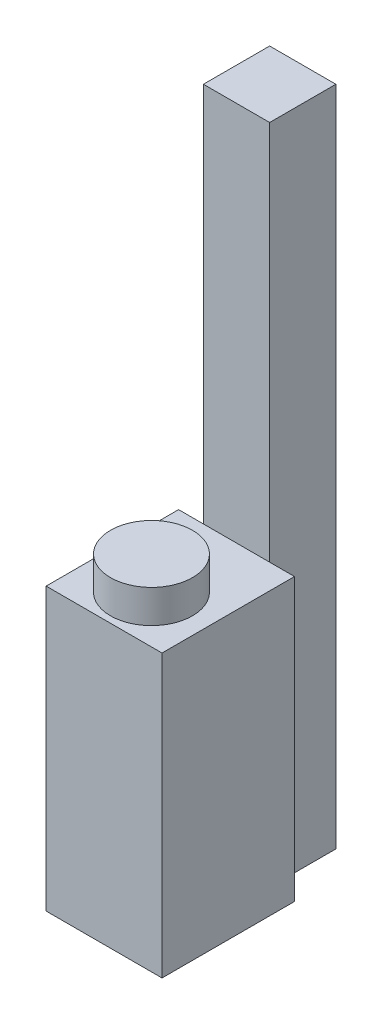
ISO-10303-21;
HEADER;
FILE_DESCRIPTION(('STEP AP214'),'2;1');
FILE_NAME('part.step','',(''),(''),'','','');
FILE_SCHEMA(('AUTOMOTIVE_DESIGN { 1 0 10303 214 1 1 1 1 }'));
ENDSEC;
DATA;
#1=APPLICATION_CONTEXT('core data for automotive mechanical design processes');
#2=APPLICATION_PROTOCOL_DEFINITION('international standard','automotive_design',2000,#1);
#3=PRODUCT_CONTEXT('',#1,'mechanical');
#4=PRODUCT('Part','Part','',(#3));
#5=PRODUCT_RELATED_PRODUCT_CATEGORY('part','',(#4));
#6=PRODUCT_DEFINITION_FORMATION('','',#4);
#7=PRODUCT_DEFINITION_CONTEXT('part definition',#1,'design');
#8=PRODUCT_DEFINITION('design','',#6,#7);
#9=PRODUCT_DEFINITION_SHAPE('','',#8);
#10=(LENGTH_UNIT() NAMED_UNIT(*) SI_UNIT(.MILLI.,.METRE.));
#11=(NAMED_UNIT(*) PLANE_ANGLE_UNIT() SI_UNIT($,.RADIAN.));
#12=(NAMED_UNIT(*) SI_UNIT($,.STERADIAN.) SOLID_ANGLE_UNIT());
#13=UNCERTAINTY_MEASURE_WITH_UNIT(LENGTH_MEASURE(1.E-05),#10,'distance_accuracy_value','');
#14=(GEOMETRIC_REPRESENTATION_CONTEXT(3) GLOBAL_UNCERTAINTY_ASSIGNED_CONTEXT((#13)) GLOBAL_UNIT_ASSIGNED_CONTEXT((#10,
#11,#12)) REPRESENTATION_CONTEXT('',''));
#15=CARTESIAN_POINT('',(0.,0.,0.));
#16=DIRECTION('',(0.,0.,1.));
#17=DIRECTION('',(1.,0.,0.));
#18=AXIS2_PLACEMENT_3D('',#15,#16,#17);
#19=CARTESIAN_POINT('',(0.,0.,-40.));
#20=DIRECTION('',(0.,0.,1.));
#21=DIRECTION('',(1.,0.,0.));
#22=AXIS2_PLACEMENT_3D('',#19,#20,#21);
#23=PLANE('',#22);
#24=DIRECTION('',(0.,1.,0.));
#25=VECTOR('',#24,1.);
#26=CARTESIAN_POINT('',(-10.,-42.5,-40.));
#27=LINE('',#26,#25);
#28=CARTESIAN_POINT('',(-10.,-42.5,-40.));
#29=VERTEX_POINT('',#28);
#30=CARTESIAN_POINT('',(-10.,42.5,-40.));
#31=VERTEX_POINT('',#30);
#32=EDGE_CURVE('E231',#29,#31,#27,.T.);
#33=ORIENTED_EDGE('',*,*,#32,.F.);
#34=DIRECTION('',(1.,0.,0.));
#35=VECTOR('',#34,1.);
#36=CARTESIAN_POINT('',(-17.5,-42.5,-40.));
#37=LINE('',#36,#35);
#38=CARTESIAN_POINT('',(-17.5,-42.5,-40.));
#39=VERTEX_POINT('',#38);
#40=EDGE_CURVE('E178',#39,#29,#37,.T.);
#41=ORIENTED_EDGE('',*,*,#40,.F.);
#42=DIRECTION('',(0.,-1.,0.));
#43=VECTOR('',#42,1.);
#44=CARTESIAN_POINT('',(-17.5,42.5,-40.));
#45=LINE('',#44,#43);
#46=CARTESIAN_POINT('',(-17.5,42.5,-40.));
#47=VERTEX_POINT('',#46);
#48=EDGE_CURVE('E172',#47,#39,#45,.T.);
#49=ORIENTED_EDGE('',*,*,#48,.F.);
#50=DIRECTION('',(-1.,0.,0.));
#51=VECTOR('',#50,1.);
#52=CARTESIAN_POINT('',(-17.5,42.5,-40.));
#53=LINE('',#52,#51);
#54=EDGE_CURVE('E62',#31,#47,#53,.T.);
#55=ORIENTED_EDGE('',*,*,#54,.F.);
#56=EDGE_LOOP('',(#33,#41,#49,#55));
#57=FACE_BOUND('',#56,.T.);
#58=ADVANCED_FACE('F41',(#57),#23,.F.);
#59=DIRECTION('',(0.,-1.,0.));
#60=VECTOR('',#59,1.);
#61=CARTESIAN_POINT('',(10.,-42.5,-40.));
#62=LINE('',#61,#60);
#63=CARTESIAN_POINT('',(10.,42.5,-40.));
#64=VERTEX_POINT('',#63);
#65=CARTESIAN_POINT('',(10.,-42.5,-40.));
#66=VERTEX_POINT('',#65);
#67=EDGE_CURVE('E11',#64,#66,#62,.T.);
#68=ORIENTED_EDGE('',*,*,#67,.F.);
#69=CARTESIAN_POINT('',(17.5,42.5,-40.));
#70=VERTEX_POINT('',#69);
#71=EDGE_CURVE('E169',#70,#64,#53,.T.);
#72=ORIENTED_EDGE('',*,*,#71,.F.);
#73=DIRECTION('',(0.,1.,0.));
#74=VECTOR('',#73,1.);
#75=CARTESIAN_POINT('',(17.5,42.5,-40.));
#76=LINE('',#75,#74);
#77=CARTESIAN_POINT('',(17.5,-42.5,-40.));
#78=VERTEX_POINT('',#77);
#79=EDGE_CURVE('E164',#78,#70,#76,.T.);
#80=ORIENTED_EDGE('',*,*,#79,.F.);
#81=EDGE_CURVE('E177',#66,#78,#37,.T.);
#82=ORIENTED_EDGE('',*,*,#81,.F.);
#83=EDGE_LOOP('',(#68,#72,#80,#82));
#84=FACE_BOUND('',#83,.T.);
#85=ADVANCED_FACE('F217',(#84),#23,.F.);
#86=CARTESIAN_POINT('',(17.5,42.5,-40.));
#87=DIRECTION('',(1.,0.,0.));
#88=DIRECTION('',(0.,1.,0.));
#89=AXIS2_PLACEMENT_3D('',#86,#87,#88);
#90=PLANE('',#89);
#91=DIRECTION('',(0.,1.,0.));
#92=VECTOR('',#91,1.);
#93=CARTESIAN_POINT('',(17.5,42.5,0.));
#94=LINE('',#93,#92);
#95=CARTESIAN_POINT('',(17.5,-42.5,0.));
#96=VERTEX_POINT('',#95);
#97=CARTESIAN_POINT('',(17.5,42.5,0.));
#98=VERTEX_POINT('',#97);
#99=EDGE_CURVE('E154',#96,#98,#94,.T.);
#100=ORIENTED_EDGE('',*,*,#99,.F.);
#101=DIRECTION('',(0.,0.,1.));
#102=VECTOR('',#101,1.);
#103=CARTESIAN_POINT('',(17.5,-42.5,-40.));
#104=LINE('',#103,#102);
#105=EDGE_CURVE('E163',#78,#96,#104,.T.);
#106=ORIENTED_EDGE('',*,*,#105,.F.);
#107=ORIENTED_EDGE('',*,*,#79,.T.);
#108=DIRECTION('',(0.,0.,1.));
#109=VECTOR('',#108,1.);
#110=CARTESIAN_POINT('',(17.5,42.5,-40.));
#111=LINE('',#110,#109);
#112=EDGE_CURVE('E45',#70,#98,#111,.T.);
#113=ORIENTED_EDGE('',*,*,#112,.T.);
#114=EDGE_LOOP('',(#100,#106,#107,#113));
#115=FACE_BOUND('',#114,.T.);
#116=ADVANCED_FACE('F43',(#115),#90,.T.);
#117=CARTESIAN_POINT('',(-17.5,-42.5,-40.));
#118=DIRECTION('',(0.,-1.,0.));
#119=DIRECTION('',(0.,0.,-1.));
#120=AXIS2_PLACEMENT_3D('',#117,#118,#119);
#121=PLANE('',#120);
#122=DIRECTION('',(1.,0.,0.));
#123=VECTOR('',#122,1.);
#124=CARTESIAN_POINT('',(-17.5,-42.5,0.));
#125=LINE('',#124,#123);
#126=CARTESIAN_POINT('',(-17.5,-42.5,0.));
#127=VERTEX_POINT('',#126);
#128=EDGE_CURVE('E168',#127,#96,#125,.T.);
#129=ORIENTED_EDGE('',*,*,#128,.F.);
#130=DIRECTION('',(0.,0.,1.));
#131=VECTOR('',#130,1.);
#132=CARTESIAN_POINT('',(-17.5,-42.5,-40.));
#133=LINE('',#132,#131);
#134=EDGE_CURVE('E197',#39,#127,#133,.T.);
#135=ORIENTED_EDGE('',*,*,#134,.F.);
#136=ORIENTED_EDGE('',*,*,#40,.T.);
#137=DIRECTION('',(0.,0.,1.));
#138=VECTOR('',#137,1.);
#139=CARTESIAN_POINT('',(-10.,-42.5,-60.));
#140=LINE('',#139,#138);
#141=CARTESIAN_POINT('',(-10.,-42.5,-60.));
#142=VERTEX_POINT('',#141);
#143=EDGE_CURVE('E235',#142,#29,#140,.T.);
#144=ORIENTED_EDGE('',*,*,#143,.F.);
#145=DIRECTION('',(-1.,0.,0.));
#146=VECTOR('',#145,1.);
#147=CARTESIAN_POINT('',(-10.,-42.5,-60.));
#148=LINE('',#147,#146);
#149=CARTESIAN_POINT('',(10.,-42.5,-60.));
#150=VERTEX_POINT('',#149);
#151=EDGE_CURVE('E139',#150,#142,#148,.T.);
#152=ORIENTED_EDGE('',*,*,#151,.F.);
#153=DIRECTION('',(0.,0.,1.));
#154=VECTOR('',#153,1.);
#155=CARTESIAN_POINT('',(10.,-42.5,-60.));
#156=LINE('',#155,#154);
#157=EDGE_CURVE('E156',#150,#66,#156,.T.);
#158=ORIENTED_EDGE('',*,*,#157,.T.);
#159=ORIENTED_EDGE('',*,*,#81,.T.);
#160=ORIENTED_EDGE('',*,*,#105,.T.);
#161=EDGE_LOOP('',(#129,#135,#136,#144,#152,#158,#159,#160));
#162=FACE_BOUND('',#161,.T.);
#163=ADVANCED_FACE('F215',(#162),#121,.T.);
#164=CARTESIAN_POINT('',(-17.5,42.5,-40.));
#165=DIRECTION('',(-1.,0.,0.));
#166=DIRECTION('',(0.,-1.,0.));
#167=AXIS2_PLACEMENT_3D('',#164,#165,#166);
#168=PLANE('',#167);
#169=DIRECTION('',(0.,-1.,0.));
#170=VECTOR('',#169,1.);
#171=CARTESIAN_POINT('',(-17.5,42.5,0.));
#172=LINE('',#171,#170);
#173=CARTESIAN_POINT('',(-17.5,42.5,0.));
#174=VERTEX_POINT('',#173);
#175=EDGE_CURVE('E188',#174,#127,#172,.T.);
#176=ORIENTED_EDGE('',*,*,#175,.F.);
#177=DIRECTION('',(0.,0.,1.));
#178=VECTOR('',#177,1.);
#179=CARTESIAN_POINT('',(-17.5,42.5,-40.));
#180=LINE('',#179,#178);
#181=EDGE_CURVE('E199',#47,#174,#180,.T.);
#182=ORIENTED_EDGE('',*,*,#181,.F.);
#183=ORIENTED_EDGE('',*,*,#48,.T.);
#184=ORIENTED_EDGE('',*,*,#134,.T.);
#185=EDGE_LOOP('',(#176,#182,#183,#184));
#186=FACE_BOUND('',#185,.T.);
#187=ADVANCED_FACE('F242',(#186),#168,.T.);
#188=CARTESIAN_POINT('',(-17.5,42.5,-40.));
#189=DIRECTION('',(0.,1.,0.));
#190=DIRECTION('',(0.,0.,1.));
#191=AXIS2_PLACEMENT_3D('',#188,#189,#190);
#192=PLANE('',#191);
#193=CARTESIAN_POINT('',(0.,42.5,-14.3165262967528));
#194=DIRECTION('',(0.,1.,0.));
#195=DIRECTION('',(0.,0.,1.));
#196=AXIS2_PLACEMENT_3D('',#193,#194,#195);
#197=CIRCLE('',#196,12.3844438908624);
#198=CARTESIAN_POINT('',(0.,42.5,-1.93208240589047));
#199=VERTEX_POINT('',#198);
#200=EDGE_CURVE('E51',#199,#199,#197,.T.);
#201=ORIENTED_EDGE('',*,*,#200,.F.);
#202=EDGE_LOOP('',(#201));
#203=FACE_BOUND('',#202,.T.);
#204=DIRECTION('',(-1.,0.,0.));
#205=VECTOR('',#204,1.);
#206=CARTESIAN_POINT('',(-17.5,42.5,0.));
#207=LINE('',#206,#205);
#208=EDGE_CURVE('E184',#98,#174,#207,.T.);
#209=ORIENTED_EDGE('',*,*,#208,.F.);
#210=ORIENTED_EDGE('',*,*,#112,.F.);
#211=ORIENTED_EDGE('',*,*,#71,.T.);
#212=EDGE_CURVE('E173',#64,#31,#53,.T.);
#213=ORIENTED_EDGE('',*,*,#212,.T.);
#214=ORIENTED_EDGE('',*,*,#54,.T.);
#215=ORIENTED_EDGE('',*,*,#181,.T.);
#216=EDGE_LOOP('',(#209,#210,#211,#213,#214,#215));
#217=FACE_BOUND('',#216,.T.);
#218=ADVANCED_FACE('F210',(#203,#217),#192,.T.);
#219=CARTESIAN_POINT('',(0.,0.,0.));
#220=DIRECTION('',(0.,0.,1.));
#221=DIRECTION('',(1.,0.,0.));
#222=AXIS2_PLACEMENT_3D('',#219,#220,#221);
#223=PLANE('',#222);
#224=ORIENTED_EDGE('',*,*,#99,.T.);
#225=ORIENTED_EDGE('',*,*,#208,.T.);
#226=ORIENTED_EDGE('',*,*,#175,.T.);
#227=ORIENTED_EDGE('',*,*,#128,.T.);
#228=EDGE_LOOP('',(#224,#225,#226,#227));
#229=FACE_BOUND('',#228,.T.);
#230=ADVANCED_FACE('F212',(#229),#223,.T.);
#231=CARTESIAN_POINT('',(0.,52.5,-14.3165262967528));
#232=DIRECTION('',(0.,-1.,0.));
#233=DIRECTION('',(0.,0.,-1.));
#234=AXIS2_PLACEMENT_3D('',#231,#232,#233);
#235=CYLINDRICAL_SURFACE('',#234,12.3844438908624);
#236=CARTESIAN_POINT('',(0.,52.5,-14.3165262967528));
#237=DIRECTION('',(0.,1.,0.));
#238=DIRECTION('',(0.,0.,1.));
#239=AXIS2_PLACEMENT_3D('',#236,#237,#238);
#240=CIRCLE('',#239,12.3844438908624);
#241=CARTESIAN_POINT('',(0.,52.5,-1.93208240589047));
#242=VERTEX_POINT('',#241);
#243=EDGE_CURVE('E150',#242,#242,#240,.T.);
#244=ORIENTED_EDGE('',*,*,#243,.F.);
#245=EDGE_LOOP('',(#244));
#246=FACE_BOUND('',#245,.T.);
#247=ORIENTED_EDGE('',*,*,#200,.T.);
#248=EDGE_LOOP('',(#247));
#249=FACE_BOUND('',#248,.T.);
#250=ADVANCED_FACE('F258',(#246,#249),#235,.T.);
#251=CARTESIAN_POINT('',(0.,52.5,-14.3165262967528));
#252=DIRECTION('',(0.,1.,0.));
#253=DIRECTION('',(0.,0.,1.));
#254=AXIS2_PLACEMENT_3D('',#251,#252,#253);
#255=PLANE('',#254);
#256=ORIENTED_EDGE('',*,*,#243,.T.);
#257=EDGE_LOOP('',(#256));
#258=FACE_BOUND('',#257,.T.);
#259=ADVANCED_FACE('F264',(#258),#255,.T.);
#260=CARTESIAN_POINT('',(-10.,-42.5,-60.));
#261=DIRECTION('',(1.,0.,0.));
#262=DIRECTION('',(0.,0.,-1.));
#263=AXIS2_PLACEMENT_3D('',#260,#261,#262);
#264=PLANE('',#263);
#265=ORIENTED_EDGE('',*,*,#32,.T.);
#266=CARTESIAN_POINT('',(-10.,157.5,-40.));
#267=VERTEX_POINT('',#266);
#268=EDGE_CURVE('E148',#31,#267,#27,.T.);
#269=ORIENTED_EDGE('',*,*,#268,.T.);
#270=DIRECTION('',(0.,0.,1.));
#271=VECTOR('',#270,1.);
#272=CARTESIAN_POINT('',(-10.,157.5,-60.));
#273=LINE('',#272,#271);
#274=CARTESIAN_POINT('',(-10.,157.5,-60.));
#275=VERTEX_POINT('',#274);
#276=EDGE_CURVE('E128',#275,#267,#273,.T.);
#277=ORIENTED_EDGE('',*,*,#276,.F.);
#278=DIRECTION('',(0.,1.,0.));
#279=VECTOR('',#278,1.);
#280=CARTESIAN_POINT('',(-10.,-42.5,-60.));
#281=LINE('',#280,#279);
#282=EDGE_CURVE('E134',#142,#275,#281,.T.);
#283=ORIENTED_EDGE('',*,*,#282,.F.);
#284=ORIENTED_EDGE('',*,*,#143,.T.);
#285=EDGE_LOOP('',(#265,#269,#277,#283,#284));
#286=FACE_BOUND('',#285,.T.);
#287=ADVANCED_FACE('F146',(#286),#264,.F.);
#288=CARTESIAN_POINT('',(-10.,157.5,-60.));
#289=DIRECTION('',(0.,-1.,0.));
#290=DIRECTION('',(0.,0.,-1.));
#291=AXIS2_PLACEMENT_3D('',#288,#289,#290);
#292=PLANE('',#291);
#293=DIRECTION('',(1.,0.,0.));
#294=VECTOR('',#293,1.);
#295=CARTESIAN_POINT('',(-10.,157.5,-40.));
#296=LINE('',#295,#294);
#297=CARTESIAN_POINT('',(10.,157.5,-40.));
#298=VERTEX_POINT('',#297);
#299=EDGE_CURVE('E228',#267,#298,#296,.T.);
#300=ORIENTED_EDGE('',*,*,#299,.T.);
#301=DIRECTION('',(0.,0.,1.));
#302=VECTOR('',#301,1.);
#303=CARTESIAN_POINT('',(10.,157.5,-60.));
#304=LINE('',#303,#302);
#305=CARTESIAN_POINT('',(10.,157.5,-60.));
#306=VERTEX_POINT('',#305);
#307=EDGE_CURVE('E130',#306,#298,#304,.T.);
#308=ORIENTED_EDGE('',*,*,#307,.F.);
#309=DIRECTION('',(1.,0.,0.));
#310=VECTOR('',#309,1.);
#311=CARTESIAN_POINT('',(-10.,157.5,-60.));
#312=LINE('',#311,#310);
#313=EDGE_CURVE('E124',#275,#306,#312,.T.);
#314=ORIENTED_EDGE('',*,*,#313,.F.);
#315=ORIENTED_EDGE('',*,*,#276,.T.);
#316=EDGE_LOOP('',(#300,#308,#314,#315));
#317=FACE_BOUND('',#316,.T.);
#318=ADVANCED_FACE('F126',(#317),#292,.F.);
#319=CARTESIAN_POINT('',(10.,-42.5,-60.));
#320=DIRECTION('',(-1.,0.,0.));
#321=DIRECTION('',(0.,0.,1.));
#322=AXIS2_PLACEMENT_3D('',#319,#320,#321);
#323=PLANE('',#322);
#324=EDGE_CURVE('E53',#298,#64,#62,.T.);
#325=ORIENTED_EDGE('',*,*,#324,.T.);
#326=ORIENTED_EDGE('',*,*,#67,.T.);
#327=ORIENTED_EDGE('',*,*,#157,.F.);
#328=DIRECTION('',(0.,-1.,0.));
#329=VECTOR('',#328,1.);
#330=CARTESIAN_POINT('',(10.,-42.5,-60.));
#331=LINE('',#330,#329);
#332=EDGE_CURVE('E133',#306,#150,#331,.T.);
#333=ORIENTED_EDGE('',*,*,#332,.F.);
#334=ORIENTED_EDGE('',*,*,#307,.T.);
#335=EDGE_LOOP('',(#325,#326,#327,#333,#334));
#336=FACE_BOUND('',#335,.T.);
#337=ADVANCED_FACE('F225',(#336),#323,.F.);
#338=CARTESIAN_POINT('',(0.,0.,-60.));
#339=DIRECTION('',(0.,0.,-1.));
#340=DIRECTION('',(-1.,0.,0.));
#341=AXIS2_PLACEMENT_3D('',#338,#339,#340);
#342=PLANE('',#341);
#343=ORIENTED_EDGE('',*,*,#282,.T.);
#344=ORIENTED_EDGE('',*,*,#313,.T.);
#345=ORIENTED_EDGE('',*,*,#332,.T.);
#346=ORIENTED_EDGE('',*,*,#151,.T.);
#347=EDGE_LOOP('',(#343,#344,#345,#346));
#348=FACE_BOUND('',#347,.T.);
#349=ADVANCED_FACE('F137',(#348),#342,.T.);
#350=CARTESIAN_POINT('',(0.,0.,-40.));
#351=DIRECTION('',(0.,0.,-1.));
#352=DIRECTION('',(-1.,0.,0.));
#353=AXIS2_PLACEMENT_3D('',#350,#351,#352);
#354=PLANE('',#353);
#355=ORIENTED_EDGE('',*,*,#212,.F.);
#356=ORIENTED_EDGE('',*,*,#324,.F.);
#357=ORIENTED_EDGE('',*,*,#299,.F.);
#358=ORIENTED_EDGE('',*,*,#268,.F.);
#359=EDGE_LOOP('',(#355,#356,#357,#358));
#360=FACE_BOUND('',#359,.T.);
#361=ADVANCED_FACE('F222',(#360),#354,.F.);
#362=CLOSED_SHELL('',(#58,#85,#116,#163,#187,#218,#230,#250,#259,#287,#318,#337,#349,#361));
#363=MANIFOLD_SOLID_BREP('B2',#362);
#364=ADVANCED_BREP_SHAPE_REPRESENTATION('',(#18,#363),#14);
#365=SHAPE_DEFINITION_REPRESENTATION(#9,#364);
ENDSEC;
END-ISO-10303-21;
